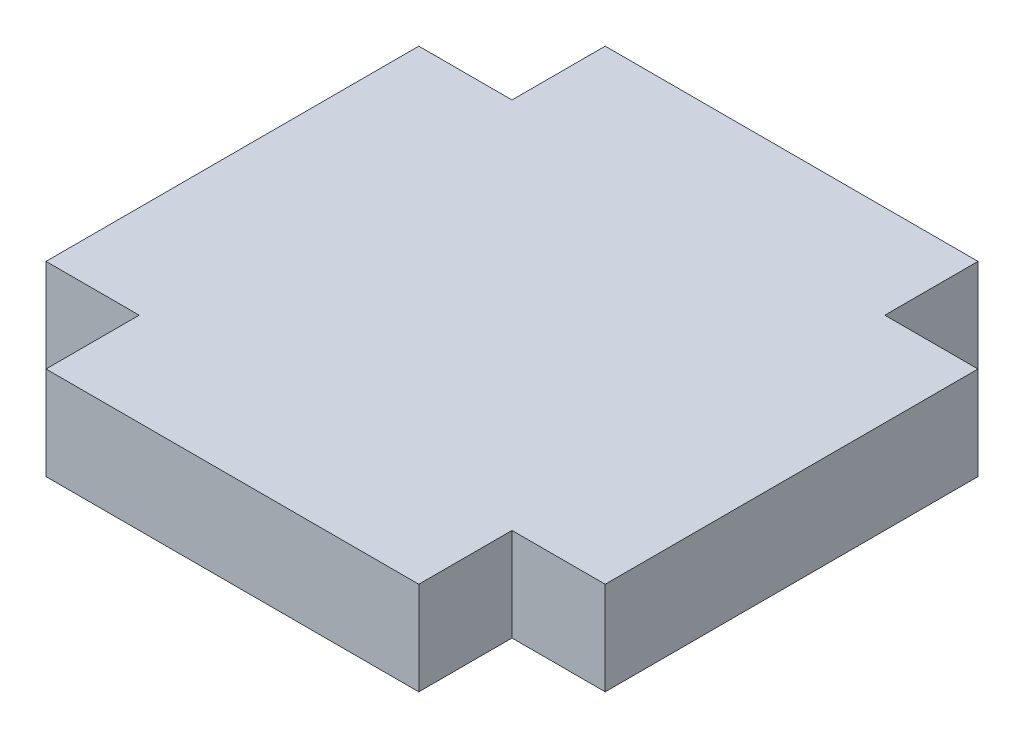
ISO-10303-21;
HEADER;
FILE_DESCRIPTION(('STEP AP214'),'2;1');
FILE_NAME('part.step','',(''),(''),'','','');
FILE_SCHEMA(('AUTOMOTIVE_DESIGN { 1 0 10303 214 1 1 1 1 }'));
ENDSEC;
DATA;
#1=APPLICATION_CONTEXT('core data for automotive mechanical design processes');
#2=APPLICATION_PROTOCOL_DEFINITION('international standard','automotive_design',2000,#1);
#3=PRODUCT_CONTEXT('',#1,'mechanical');
#4=PRODUCT('Part','Part','',(#3));
#5=PRODUCT_RELATED_PRODUCT_CATEGORY('part','',(#4));
#6=PRODUCT_DEFINITION_FORMATION('','',#4);
#7=PRODUCT_DEFINITION_CONTEXT('part definition',#1,'design');
#8=PRODUCT_DEFINITION('design','',#6,#7);
#9=PRODUCT_DEFINITION_SHAPE('','',#8);
#10=(LENGTH_UNIT() NAMED_UNIT(*) SI_UNIT(.MILLI.,.METRE.));
#11=(NAMED_UNIT(*) PLANE_ANGLE_UNIT() SI_UNIT($,.RADIAN.));
#12=(NAMED_UNIT(*) SI_UNIT($,.STERADIAN.) SOLID_ANGLE_UNIT());
#13=UNCERTAINTY_MEASURE_WITH_UNIT(LENGTH_MEASURE(1.E-05),#10,'distance_accuracy_value','');
#14=(GEOMETRIC_REPRESENTATION_CONTEXT(3) GLOBAL_UNCERTAINTY_ASSIGNED_CONTEXT((#13)) GLOBAL_UNIT_ASSIGNED_CONTEXT((#10,
#11,#12)) REPRESENTATION_CONTEXT('',''));
#15=CARTESIAN_POINT('',(0.,0.,0.));
#16=DIRECTION('',(0.,0.,1.));
#17=DIRECTION('',(1.,0.,0.));
#18=AXIS2_PLACEMENT_3D('',#15,#16,#17);
#19=CARTESIAN_POINT('',(-6.35,1.5875,-6.35));
#20=DIRECTION('',(0.,0.,1.));
#21=DIRECTION('',(1.,0.,0.));
#22=AXIS2_PLACEMENT_3D('',#19,#20,#21);
#23=PLANE('',#22);
#24=DIRECTION('',(-1.,0.,0.));
#25=VECTOR('',#24,1.);
#26=CARTESIAN_POINT('',(-6.35,-1.5875,-6.35));
#27=LINE('',#26,#25);
#28=CARTESIAN_POINT('',(-6.35,-1.5875,-6.35));
#29=VERTEX_POINT('',#28);
#30=CARTESIAN_POINT('',(-9.525,-1.5875,-6.35));
#31=VERTEX_POINT('',#30);
#32=EDGE_CURVE('E159',#29,#31,#27,.T.);
#33=ORIENTED_EDGE('',*,*,#32,.T.);
#34=DIRECTION('',(0.,-1.,0.));
#35=VECTOR('',#34,1.);
#36=CARTESIAN_POINT('',(-9.525,1.5875,-6.35));
#37=LINE('',#36,#35);
#38=CARTESIAN_POINT('',(-9.525,1.5875,-6.35));
#39=VERTEX_POINT('',#38);
#40=EDGE_CURVE('E11',#39,#31,#37,.T.);
#41=ORIENTED_EDGE('',*,*,#40,.F.);
#42=DIRECTION('',(-1.,0.,0.));
#43=VECTOR('',#42,1.);
#44=CARTESIAN_POINT('',(-6.35,1.5875,-6.35));
#45=LINE('',#44,#43);
#46=CARTESIAN_POINT('',(-6.35,1.5875,-6.35));
#47=VERTEX_POINT('',#46);
#48=EDGE_CURVE('E181',#47,#39,#45,.T.);
#49=ORIENTED_EDGE('',*,*,#48,.F.);
#50=DIRECTION('',(0.,-1.,0.));
#51=VECTOR('',#50,1.);
#52=CARTESIAN_POINT('',(-6.35,1.5875,-6.35));
#53=LINE('',#52,#51);
#54=EDGE_CURVE('E155',#47,#29,#53,.T.);
#55=ORIENTED_EDGE('',*,*,#54,.T.);
#56=EDGE_LOOP('',(#33,#41,#49,#55));
#57=FACE_BOUND('',#56,.T.);
#58=ADVANCED_FACE('F39',(#57),#23,.F.);
#59=CARTESIAN_POINT('',(-9.525,1.5875,-6.35));
#60=DIRECTION('',(1.,0.,0.));
#61=DIRECTION('',(0.,0.,-1.));
#62=AXIS2_PLACEMENT_3D('',#59,#60,#61);
#63=PLANE('',#62);
#64=DIRECTION('',(0.,0.,1.));
#65=VECTOR('',#64,1.);
#66=CARTESIAN_POINT('',(-9.525,-1.5875,-6.35));
#67=LINE('',#66,#65);
#68=CARTESIAN_POINT('',(-9.525,-1.5875,6.35));
#69=VERTEX_POINT('',#68);
#70=EDGE_CURVE('E162',#31,#69,#67,.T.);
#71=ORIENTED_EDGE('',*,*,#70,.T.);
#72=DIRECTION('',(0.,-1.,0.));
#73=VECTOR('',#72,1.);
#74=CARTESIAN_POINT('',(-9.525,1.5875,6.35));
#75=LINE('',#74,#73);
#76=CARTESIAN_POINT('',(-9.525,1.5875,6.35));
#77=VERTEX_POINT('',#76);
#78=EDGE_CURVE('E47',#77,#69,#75,.T.);
#79=ORIENTED_EDGE('',*,*,#78,.F.);
#80=DIRECTION('',(0.,0.,1.));
#81=VECTOR('',#80,1.);
#82=CARTESIAN_POINT('',(-9.525,1.5875,-6.35));
#83=LINE('',#82,#81);
#84=EDGE_CURVE('E110',#39,#77,#83,.T.);
#85=ORIENTED_EDGE('',*,*,#84,.F.);
#86=ORIENTED_EDGE('',*,*,#40,.T.);
#87=EDGE_LOOP('',(#71,#79,#85,#86));
#88=FACE_BOUND('',#87,.T.);
#89=ADVANCED_FACE('F259',(#88),#63,.F.);
#90=CARTESIAN_POINT('',(-9.525,1.5875,6.35));
#91=DIRECTION('',(0.,0.,-1.));
#92=DIRECTION('',(-1.,0.,0.));
#93=AXIS2_PLACEMENT_3D('',#90,#91,#92);
#94=PLANE('',#93);
#95=DIRECTION('',(1.,0.,0.));
#96=VECTOR('',#95,1.);
#97=CARTESIAN_POINT('',(-9.525,-1.5875,6.35));
#98=LINE('',#97,#96);
#99=CARTESIAN_POINT('',(-6.35,-1.5875,6.35));
#100=VERTEX_POINT('',#99);
#101=EDGE_CURVE('E164',#69,#100,#98,.T.);
#102=ORIENTED_EDGE('',*,*,#101,.T.);
#103=DIRECTION('',(0.,-1.,0.));
#104=VECTOR('',#103,1.);
#105=CARTESIAN_POINT('',(-6.35,1.5875,6.35));
#106=LINE('',#105,#104);
#107=CARTESIAN_POINT('',(-6.35,1.5875,6.35));
#108=VERTEX_POINT('',#107);
#109=EDGE_CURVE('E200',#108,#100,#106,.T.);
#110=ORIENTED_EDGE('',*,*,#109,.F.);
#111=DIRECTION('',(1.,0.,0.));
#112=VECTOR('',#111,1.);
#113=CARTESIAN_POINT('',(-9.525,1.5875,6.35));
#114=LINE('',#113,#112);
#115=EDGE_CURVE('E208',#77,#108,#114,.T.);
#116=ORIENTED_EDGE('',*,*,#115,.F.);
#117=ORIENTED_EDGE('',*,*,#78,.T.);
#118=EDGE_LOOP('',(#102,#110,#116,#117));
#119=FACE_BOUND('',#118,.T.);
#120=ADVANCED_FACE('F206',(#119),#94,.F.);
#121=CARTESIAN_POINT('',(-6.35,1.5875,6.35));
#122=DIRECTION('',(1.,0.,0.));
#123=DIRECTION('',(0.,0.,-1.));
#124=AXIS2_PLACEMENT_3D('',#121,#122,#123);
#125=PLANE('',#124);
#126=DIRECTION('',(0.,0.,1.));
#127=VECTOR('',#126,1.);
#128=CARTESIAN_POINT('',(-6.35,-1.5875,6.35));
#129=LINE('',#128,#127);
#130=CARTESIAN_POINT('',(-6.35,-1.5875,9.525));
#131=VERTEX_POINT('',#130);
#132=EDGE_CURVE('E166',#100,#131,#129,.T.);
#133=ORIENTED_EDGE('',*,*,#132,.T.);
#134=DIRECTION('',(0.,-1.,0.));
#135=VECTOR('',#134,1.);
#136=CARTESIAN_POINT('',(-6.35,1.5875,9.525));
#137=LINE('',#136,#135);
#138=CARTESIAN_POINT('',(-6.35,1.5875,9.525));
#139=VERTEX_POINT('',#138);
#140=EDGE_CURVE('E197',#139,#131,#137,.T.);
#141=ORIENTED_EDGE('',*,*,#140,.F.);
#142=DIRECTION('',(0.,0.,1.));
#143=VECTOR('',#142,1.);
#144=CARTESIAN_POINT('',(-6.35,1.5875,6.35));
#145=LINE('',#144,#143);
#146=EDGE_CURVE('E226',#108,#139,#145,.T.);
#147=ORIENTED_EDGE('',*,*,#146,.F.);
#148=ORIENTED_EDGE('',*,*,#109,.T.);
#149=EDGE_LOOP('',(#133,#141,#147,#148));
#150=FACE_BOUND('',#149,.T.);
#151=ADVANCED_FACE('F217',(#150),#125,.F.);
#152=CARTESIAN_POINT('',(-6.35,1.5875,9.525));
#153=DIRECTION('',(0.,0.,-1.));
#154=DIRECTION('',(-1.,0.,0.));
#155=AXIS2_PLACEMENT_3D('',#152,#153,#154);
#156=PLANE('',#155);
#157=DIRECTION('',(1.,0.,0.));
#158=VECTOR('',#157,1.);
#159=CARTESIAN_POINT('',(-6.35,-1.5875,9.525));
#160=LINE('',#159,#158);
#161=CARTESIAN_POINT('',(6.35,-1.5875,9.525));
#162=VERTEX_POINT('',#161);
#163=EDGE_CURVE('E168',#131,#162,#160,.T.);
#164=ORIENTED_EDGE('',*,*,#163,.T.);
#165=DIRECTION('',(0.,-1.,0.));
#166=VECTOR('',#165,1.);
#167=CARTESIAN_POINT('',(6.35,1.5875,9.525));
#168=LINE('',#167,#166);
#169=CARTESIAN_POINT('',(6.35,1.5875,9.525));
#170=VERTEX_POINT('',#169);
#171=EDGE_CURVE('E194',#170,#162,#168,.T.);
#172=ORIENTED_EDGE('',*,*,#171,.F.);
#173=DIRECTION('',(1.,0.,0.));
#174=VECTOR('',#173,1.);
#175=CARTESIAN_POINT('',(-6.35,1.5875,9.525));
#176=LINE('',#175,#174);
#177=EDGE_CURVE('E223',#139,#170,#176,.T.);
#178=ORIENTED_EDGE('',*,*,#177,.F.);
#179=ORIENTED_EDGE('',*,*,#140,.T.);
#180=EDGE_LOOP('',(#164,#172,#178,#179));
#181=FACE_BOUND('',#180,.T.);
#182=ADVANCED_FACE('F221',(#181),#156,.F.);
#183=CARTESIAN_POINT('',(6.35,1.5875,9.525));
#184=DIRECTION('',(-1.,0.,0.));
#185=DIRECTION('',(0.,0.,1.));
#186=AXIS2_PLACEMENT_3D('',#183,#184,#185);
#187=PLANE('',#186);
#188=DIRECTION('',(0.,0.,-1.));
#189=VECTOR('',#188,1.);
#190=CARTESIAN_POINT('',(6.35,-1.5875,9.525));
#191=LINE('',#190,#189);
#192=CARTESIAN_POINT('',(6.35,-1.5875,6.35));
#193=VERTEX_POINT('',#192);
#194=EDGE_CURVE('E170',#162,#193,#191,.T.);
#195=ORIENTED_EDGE('',*,*,#194,.T.);
#196=DIRECTION('',(0.,-1.,0.));
#197=VECTOR('',#196,1.);
#198=CARTESIAN_POINT('',(6.35,1.5875,6.35));
#199=LINE('',#198,#197);
#200=CARTESIAN_POINT('',(6.35,1.5875,6.35));
#201=VERTEX_POINT('',#200);
#202=EDGE_CURVE('E191',#201,#193,#199,.T.);
#203=ORIENTED_EDGE('',*,*,#202,.F.);
#204=DIRECTION('',(0.,0.,-1.));
#205=VECTOR('',#204,1.);
#206=CARTESIAN_POINT('',(6.35,1.5875,9.525));
#207=LINE('',#206,#205);
#208=EDGE_CURVE('E225',#170,#201,#207,.T.);
#209=ORIENTED_EDGE('',*,*,#208,.F.);
#210=ORIENTED_EDGE('',*,*,#171,.T.);
#211=EDGE_LOOP('',(#195,#203,#209,#210));
#212=FACE_BOUND('',#211,.T.);
#213=ADVANCED_FACE('F272',(#212),#187,.F.);
#214=CARTESIAN_POINT('',(6.35,1.5875,6.35));
#215=DIRECTION('',(0.,0.,-1.));
#216=DIRECTION('',(-1.,0.,0.));
#217=AXIS2_PLACEMENT_3D('',#214,#215,#216);
#218=PLANE('',#217);
#219=DIRECTION('',(1.,0.,0.));
#220=VECTOR('',#219,1.);
#221=CARTESIAN_POINT('',(6.35,-1.5875,6.35));
#222=LINE('',#221,#220);
#223=CARTESIAN_POINT('',(9.525,-1.5875,6.35));
#224=VERTEX_POINT('',#223);
#225=EDGE_CURVE('E172',#193,#224,#222,.T.);
#226=ORIENTED_EDGE('',*,*,#225,.T.);
#227=DIRECTION('',(0.,-1.,0.));
#228=VECTOR('',#227,1.);
#229=CARTESIAN_POINT('',(9.525,1.5875,6.35));
#230=LINE('',#229,#228);
#231=CARTESIAN_POINT('',(9.525,1.5875,6.35));
#232=VERTEX_POINT('',#231);
#233=EDGE_CURVE('E188',#232,#224,#230,.T.);
#234=ORIENTED_EDGE('',*,*,#233,.F.);
#235=DIRECTION('',(1.,0.,0.));
#236=VECTOR('',#235,1.);
#237=CARTESIAN_POINT('',(6.35,1.5875,6.35));
#238=LINE('',#237,#236);
#239=EDGE_CURVE('E228',#201,#232,#238,.T.);
#240=ORIENTED_EDGE('',*,*,#239,.F.);
#241=ORIENTED_EDGE('',*,*,#202,.T.);
#242=EDGE_LOOP('',(#226,#234,#240,#241));
#243=FACE_BOUND('',#242,.T.);
#244=ADVANCED_FACE('F275',(#243),#218,.F.);
#245=CARTESIAN_POINT('',(9.525,1.5875,6.35));
#246=DIRECTION('',(-1.,0.,0.));
#247=DIRECTION('',(0.,0.,1.));
#248=AXIS2_PLACEMENT_3D('',#245,#246,#247);
#249=PLANE('',#248);
#250=DIRECTION('',(0.,0.,-1.));
#251=VECTOR('',#250,1.);
#252=CARTESIAN_POINT('',(9.525,-1.5875,6.35));
#253=LINE('',#252,#251);
#254=CARTESIAN_POINT('',(9.525,-1.5875,-6.35));
#255=VERTEX_POINT('',#254);
#256=EDGE_CURVE('E174',#224,#255,#253,.T.);
#257=ORIENTED_EDGE('',*,*,#256,.T.);
#258=DIRECTION('',(0.,-1.,0.));
#259=VECTOR('',#258,1.);
#260=CARTESIAN_POINT('',(9.525,1.5875,-6.35));
#261=LINE('',#260,#259);
#262=CARTESIAN_POINT('',(9.525,1.5875,-6.35));
#263=VERTEX_POINT('',#262);
#264=EDGE_CURVE('E185',#263,#255,#261,.T.);
#265=ORIENTED_EDGE('',*,*,#264,.F.);
#266=DIRECTION('',(0.,0.,-1.));
#267=VECTOR('',#266,1.);
#268=CARTESIAN_POINT('',(9.525,1.5875,6.35));
#269=LINE('',#268,#267);
#270=EDGE_CURVE('E234',#232,#263,#269,.T.);
#271=ORIENTED_EDGE('',*,*,#270,.F.);
#272=ORIENTED_EDGE('',*,*,#233,.T.);
#273=EDGE_LOOP('',(#257,#265,#271,#272));
#274=FACE_BOUND('',#273,.T.);
#275=ADVANCED_FACE('F240',(#274),#249,.F.);
#276=CARTESIAN_POINT('',(9.525,1.5875,-6.35));
#277=DIRECTION('',(0.,0.,1.));
#278=DIRECTION('',(1.,0.,0.));
#279=AXIS2_PLACEMENT_3D('',#276,#277,#278);
#280=PLANE('',#279);
#281=DIRECTION('',(-1.,0.,0.));
#282=VECTOR('',#281,1.);
#283=CARTESIAN_POINT('',(9.525,-1.5875,-6.35));
#284=LINE('',#283,#282);
#285=CARTESIAN_POINT('',(6.35,-1.5875,-6.35));
#286=VERTEX_POINT('',#285);
#287=EDGE_CURVE('E176',#255,#286,#284,.T.);
#288=ORIENTED_EDGE('',*,*,#287,.T.);
#289=DIRECTION('',(0.,-1.,0.));
#290=VECTOR('',#289,1.);
#291=CARTESIAN_POINT('',(6.35,1.5875,-6.35));
#292=LINE('',#291,#290);
#293=CARTESIAN_POINT('',(6.35,1.5875,-6.35));
#294=VERTEX_POINT('',#293);
#295=EDGE_CURVE('E150',#294,#286,#292,.T.);
#296=ORIENTED_EDGE('',*,*,#295,.F.);
#297=DIRECTION('',(-1.,0.,0.));
#298=VECTOR('',#297,1.);
#299=CARTESIAN_POINT('',(9.525,1.5875,-6.35));
#300=LINE('',#299,#298);
#301=EDGE_CURVE('E141',#263,#294,#300,.T.);
#302=ORIENTED_EDGE('',*,*,#301,.F.);
#303=ORIENTED_EDGE('',*,*,#264,.T.);
#304=EDGE_LOOP('',(#288,#296,#302,#303));
#305=FACE_BOUND('',#304,.T.);
#306=ADVANCED_FACE('F244',(#305),#280,.F.);
#307=CARTESIAN_POINT('',(6.35,1.5875,-6.35));
#308=DIRECTION('',(-1.,0.,0.));
#309=DIRECTION('',(0.,0.,1.));
#310=AXIS2_PLACEMENT_3D('',#307,#308,#309);
#311=PLANE('',#310);
#312=DIRECTION('',(0.,0.,-1.));
#313=VECTOR('',#312,1.);
#314=CARTESIAN_POINT('',(6.35,-1.5875,-6.35));
#315=LINE('',#314,#313);
#316=CARTESIAN_POINT('',(6.35,-1.5875,-9.525));
#317=VERTEX_POINT('',#316);
#318=EDGE_CURVE('E149',#286,#317,#315,.T.);
#319=ORIENTED_EDGE('',*,*,#318,.T.);
#320=DIRECTION('',(0.,-1.,0.));
#321=VECTOR('',#320,1.);
#322=CARTESIAN_POINT('',(6.35,1.5875,-9.525));
#323=LINE('',#322,#321);
#324=CARTESIAN_POINT('',(6.35,1.5875,-9.525));
#325=VERTEX_POINT('',#324);
#326=EDGE_CURVE('E146',#325,#317,#323,.T.);
#327=ORIENTED_EDGE('',*,*,#326,.F.);
#328=DIRECTION('',(0.,0.,-1.));
#329=VECTOR('',#328,1.);
#330=CARTESIAN_POINT('',(6.35,1.5875,-6.35));
#331=LINE('',#330,#329);
#332=EDGE_CURVE('E135',#294,#325,#331,.T.);
#333=ORIENTED_EDGE('',*,*,#332,.F.);
#334=ORIENTED_EDGE('',*,*,#295,.T.);
#335=EDGE_LOOP('',(#319,#327,#333,#334));
#336=FACE_BOUND('',#335,.T.);
#337=ADVANCED_FACE('F147',(#336),#311,.F.);
#338=CARTESIAN_POINT('',(6.35,1.5875,-9.525));
#339=DIRECTION('',(0.,0.,1.));
#340=DIRECTION('',(1.,0.,0.));
#341=AXIS2_PLACEMENT_3D('',#338,#339,#340);
#342=PLANE('',#341);
#343=DIRECTION('',(-1.,0.,0.));
#344=VECTOR('',#343,1.);
#345=CARTESIAN_POINT('',(6.35,-1.5875,-9.525));
#346=LINE('',#345,#344);
#347=CARTESIAN_POINT('',(-6.35,-1.5875,-9.525));
#348=VERTEX_POINT('',#347);
#349=EDGE_CURVE('E96',#317,#348,#346,.T.);
#350=ORIENTED_EDGE('',*,*,#349,.T.);
#351=DIRECTION('',(0.,-1.,0.));
#352=VECTOR('',#351,1.);
#353=CARTESIAN_POINT('',(-6.35,1.5875,-9.525));
#354=LINE('',#353,#352);
#355=CARTESIAN_POINT('',(-6.35,1.5875,-9.525));
#356=VERTEX_POINT('',#355);
#357=EDGE_CURVE('E151',#356,#348,#354,.T.);
#358=ORIENTED_EDGE('',*,*,#357,.F.);
#359=DIRECTION('',(-1.,0.,0.));
#360=VECTOR('',#359,1.);
#361=CARTESIAN_POINT('',(6.35,1.5875,-9.525));
#362=LINE('',#361,#360);
#363=EDGE_CURVE('E139',#325,#356,#362,.T.);
#364=ORIENTED_EDGE('',*,*,#363,.F.);
#365=ORIENTED_EDGE('',*,*,#326,.T.);
#366=EDGE_LOOP('',(#350,#358,#364,#365));
#367=FACE_BOUND('',#366,.T.);
#368=ADVANCED_FACE('F153',(#367),#342,.F.);
#369=CARTESIAN_POINT('',(-6.35,1.5875,-9.525));
#370=DIRECTION('',(1.,0.,0.));
#371=DIRECTION('',(0.,0.,-1.));
#372=AXIS2_PLACEMENT_3D('',#369,#370,#371);
#373=PLANE('',#372);
#374=DIRECTION('',(0.,0.,1.));
#375=VECTOR('',#374,1.);
#376=CARTESIAN_POINT('',(-6.35,-1.5875,-9.525));
#377=LINE('',#376,#375);
#378=EDGE_CURVE('E102',#348,#29,#377,.T.);
#379=ORIENTED_EDGE('',*,*,#378,.T.);
#380=ORIENTED_EDGE('',*,*,#54,.F.);
#381=DIRECTION('',(0.,0.,1.));
#382=VECTOR('',#381,1.);
#383=CARTESIAN_POINT('',(-6.35,1.5875,-9.525));
#384=LINE('',#383,#382);
#385=EDGE_CURVE('E55',#356,#47,#384,.T.);
#386=ORIENTED_EDGE('',*,*,#385,.F.);
#387=ORIENTED_EDGE('',*,*,#357,.T.);
#388=EDGE_LOOP('',(#379,#380,#386,#387));
#389=FACE_BOUND('',#388,.T.);
#390=ADVANCED_FACE('F248',(#389),#373,.F.);
#391=CARTESIAN_POINT('',(0.,1.5875,0.));
#392=DIRECTION('',(0.,1.,0.));
#393=DIRECTION('',(0.,0.,1.));
#394=AXIS2_PLACEMENT_3D('',#391,#392,#393);
#395=PLANE('',#394);
#396=ORIENTED_EDGE('',*,*,#48,.T.);
#397=ORIENTED_EDGE('',*,*,#84,.T.);
#398=ORIENTED_EDGE('',*,*,#115,.T.);
#399=ORIENTED_EDGE('',*,*,#146,.T.);
#400=ORIENTED_EDGE('',*,*,#177,.T.);
#401=ORIENTED_EDGE('',*,*,#208,.T.);
#402=ORIENTED_EDGE('',*,*,#239,.T.);
#403=ORIENTED_EDGE('',*,*,#270,.T.);
#404=ORIENTED_EDGE('',*,*,#301,.T.);
#405=ORIENTED_EDGE('',*,*,#332,.T.);
#406=ORIENTED_EDGE('',*,*,#363,.T.);
#407=ORIENTED_EDGE('',*,*,#385,.T.);
#408=EDGE_LOOP('',(#396,#397,#398,#399,#400,#401,#402,#403,#404,#405,#406,#407));
#409=FACE_BOUND('',#408,.T.);
#410=ADVANCED_FACE('F137',(#409),#395,.T.);
#411=CARTESIAN_POINT('',(0.,-1.5875,0.));
#412=DIRECTION('',(0.,1.,0.));
#413=DIRECTION('',(0.,0.,1.));
#414=AXIS2_PLACEMENT_3D('',#411,#412,#413);
#415=PLANE('',#414);
#416=ORIENTED_EDGE('',*,*,#32,.F.);
#417=ORIENTED_EDGE('',*,*,#378,.F.);
#418=ORIENTED_EDGE('',*,*,#349,.F.);
#419=ORIENTED_EDGE('',*,*,#318,.F.);
#420=ORIENTED_EDGE('',*,*,#287,.F.);
#421=ORIENTED_EDGE('',*,*,#256,.F.);
#422=ORIENTED_EDGE('',*,*,#225,.F.);
#423=ORIENTED_EDGE('',*,*,#194,.F.);
#424=ORIENTED_EDGE('',*,*,#163,.F.);
#425=ORIENTED_EDGE('',*,*,#132,.F.);
#426=ORIENTED_EDGE('',*,*,#101,.F.);
#427=ORIENTED_EDGE('',*,*,#70,.F.);
#428=EDGE_LOOP('',(#416,#417,#418,#419,#420,#421,#422,#423,#424,#425,#426,#427));
#429=FACE_BOUND('',#428,.T.);
#430=ADVANCED_FACE('F212',(#429),#415,.F.);
#431=CLOSED_SHELL('',(#58,#89,#120,#151,#182,#213,#244,#275,#306,#337,#368,#390,#410,#430));
#432=MANIFOLD_SOLID_BREP('B2',#431);
#433=ADVANCED_BREP_SHAPE_REPRESENTATION('',(#18,#432),#14);
#434=SHAPE_DEFINITION_REPRESENTATION(#9,#433);
ENDSEC;
END-ISO-10303-21;
